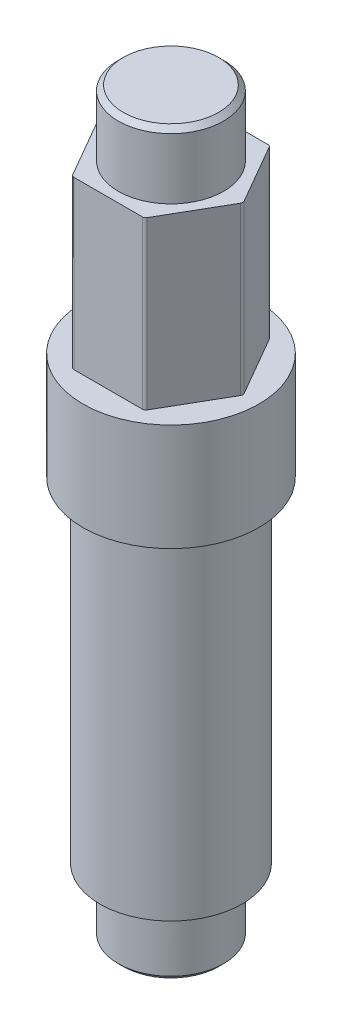
ISO-10303-21;
HEADER;
FILE_DESCRIPTION(('STEP AP214'),'2;1');
FILE_NAME('part.step','',(''),(''),'','','');
FILE_SCHEMA(('AUTOMOTIVE_DESIGN { 1 0 10303 214 1 1 1 1 }'));
ENDSEC;
DATA;
#1=APPLICATION_CONTEXT('core data for automotive mechanical design processes');
#2=APPLICATION_PROTOCOL_DEFINITION('international standard','automotive_design',2000,#1);
#3=PRODUCT_CONTEXT('',#1,'mechanical');
#4=PRODUCT('Part','Part','',(#3));
#5=PRODUCT_RELATED_PRODUCT_CATEGORY('part','',(#4));
#6=PRODUCT_DEFINITION_FORMATION('','',#4);
#7=PRODUCT_DEFINITION_CONTEXT('part definition',#1,'design');
#8=PRODUCT_DEFINITION('design','',#6,#7);
#9=PRODUCT_DEFINITION_SHAPE('','',#8);
#10=(LENGTH_UNIT() NAMED_UNIT(*) SI_UNIT(.MILLI.,.METRE.));
#11=(NAMED_UNIT(*) PLANE_ANGLE_UNIT() SI_UNIT($,.RADIAN.));
#12=(NAMED_UNIT(*) SI_UNIT($,.STERADIAN.) SOLID_ANGLE_UNIT());
#13=UNCERTAINTY_MEASURE_WITH_UNIT(LENGTH_MEASURE(1.E-05),#10,'distance_accuracy_value','');
#14=(GEOMETRIC_REPRESENTATION_CONTEXT(3) GLOBAL_UNCERTAINTY_ASSIGNED_CONTEXT((#13)) GLOBAL_UNIT_ASSIGNED_CONTEXT((#10,
#11,#12)) REPRESENTATION_CONTEXT('',''));
#15=CARTESIAN_POINT('',(0.,0.,0.));
#16=DIRECTION('',(0.,0.,1.));
#17=DIRECTION('',(1.,0.,0.));
#18=AXIS2_PLACEMENT_3D('',#15,#16,#17);
#19=CARTESIAN_POINT('',(-6.6802,46.1772,0.));
#20=DIRECTION('',(0.,1.,0.));
#21=DIRECTION('',(1.,0.,0.));
#22=AXIS2_PLACEMENT_3D('',#19,#20,#21);
#23=PLANE('',#22);
#24=CARTESIAN_POINT('',(0.,46.1772,0.));
#25=DIRECTION('',(0.,1.,0.));
#26=DIRECTION('',(0.,0.,1.));
#27=AXIS2_PLACEMENT_3D('',#24,#25,#26);
#28=CIRCLE('',#27,4.000000001);
#29=CARTESIAN_POINT('',(0.,46.1772,4.000000001));
#30=VERTEX_POINT('',#29);
#31=EDGE_CURVE('E206',#30,#30,#28,.T.);
#32=ORIENTED_EDGE('',*,*,#31,.F.);
#33=EDGE_LOOP('',(#32));
#34=FACE_BOUND('',#33,.T.);
#35=DIRECTION('',(0.5,0.,0.866025403784439));
#36=VECTOR('',#35,1.);
#37=CARTESIAN_POINT('',(-5.42593782984411,46.1772,0.127000000000003));
#38=LINE('',#37,#36);
#39=CARTESIAN_POINT('',(-5.42593782984411,46.1772,0.127000000000003));
#40=VERTEX_POINT('',#39);
#41=CARTESIAN_POINT('',(-2.82295414120268,46.1772,4.6355));
#42=VERTEX_POINT('',#41);
#43=EDGE_CURVE('E296',#40,#42,#38,.T.);
#44=ORIENTED_EDGE('',*,*,#43,.T.);
#45=CARTESIAN_POINT('',(-2.60298368864143,46.1772,4.5085));
#46=DIRECTION('',(0.,1.,0.));
#47=DIRECTION('',(0.,0.,1.));
#48=AXIS2_PLACEMENT_3D('',#45,#46,#47);
#49=CIRCLE('',#48,0.254);
#50=CARTESIAN_POINT('',(-2.60298368864143,46.1772,4.7625));
#51=VERTEX_POINT('',#50);
#52=EDGE_CURVE('E286',#42,#51,#49,.T.);
#53=ORIENTED_EDGE('',*,*,#52,.T.);
#54=DIRECTION('',(1.,0.,0.));
#55=VECTOR('',#54,1.);
#56=CARTESIAN_POINT('',(-2.60298368864143,46.1772,4.7625));
#57=LINE('',#56,#55);
#58=CARTESIAN_POINT('',(2.60298368864142,46.1772,4.7625));
#59=VERTEX_POINT('',#58);
#60=EDGE_CURVE('E11',#51,#59,#57,.T.);
#61=ORIENTED_EDGE('',*,*,#60,.T.);
#62=CARTESIAN_POINT('',(2.60298368864142,46.1772,4.5085));
#63=DIRECTION('',(0.,1.,0.));
#64=DIRECTION('',(0.,0.,1.));
#65=AXIS2_PLACEMENT_3D('',#62,#63,#64);
#66=CIRCLE('',#65,0.254);
#67=CARTESIAN_POINT('',(2.82295414120268,46.1772,4.6355));
#68=VERTEX_POINT('',#67);
#69=EDGE_CURVE('E50',#59,#68,#66,.T.);
#70=ORIENTED_EDGE('',*,*,#69,.T.);
#71=DIRECTION('',(0.5,0.,-0.866025403784439));
#72=VECTOR('',#71,1.);
#73=CARTESIAN_POINT('',(2.82295414120268,46.1772,4.6355));
#74=LINE('',#73,#72);
#75=CARTESIAN_POINT('',(5.4259378298441,46.1772,0.126999999999999));
#76=VERTEX_POINT('',#75);
#77=EDGE_CURVE('E132',#68,#76,#74,.T.);
#78=ORIENTED_EDGE('',*,*,#77,.T.);
#79=CARTESIAN_POINT('',(5.20596737728286,46.1772,0.));
#80=DIRECTION('',(0.,1.,0.));
#81=DIRECTION('',(0.,0.,1.));
#82=AXIS2_PLACEMENT_3D('',#79,#80,#81);
#83=CIRCLE('',#82,0.254);
#84=CARTESIAN_POINT('',(5.4259378298441,46.1772,-0.127000000000003));
#85=VERTEX_POINT('',#84);
#86=EDGE_CURVE('E126',#76,#85,#83,.T.);
#87=ORIENTED_EDGE('',*,*,#86,.T.);
#88=DIRECTION('',(-0.5,0.,-0.866025403784439));
#89=VECTOR('',#88,1.);
#90=CARTESIAN_POINT('',(5.4259378298441,46.1772,-0.127000000000003));
#91=LINE('',#90,#89);
#92=CARTESIAN_POINT('',(2.82295414120266,46.1772,-4.6355));
#93=VERTEX_POINT('',#92);
#94=EDGE_CURVE('E129',#85,#93,#91,.T.);
#95=ORIENTED_EDGE('',*,*,#94,.T.);
#96=CARTESIAN_POINT('',(2.60298368864142,46.1772,-4.5085));
#97=DIRECTION('',(0.,1.,0.));
#98=DIRECTION('',(0.,0.,1.));
#99=AXIS2_PLACEMENT_3D('',#96,#97,#98);
#100=CIRCLE('',#99,0.254);
#101=CARTESIAN_POINT('',(2.60298368864142,46.1772,-4.7625));
#102=VERTEX_POINT('',#101);
#103=EDGE_CURVE('E157',#93,#102,#100,.T.);
#104=ORIENTED_EDGE('',*,*,#103,.T.);
#105=DIRECTION('',(-1.,0.,0.));
#106=VECTOR('',#105,1.);
#107=CARTESIAN_POINT('',(2.60298368864142,46.1772,-4.7625));
#108=LINE('',#107,#106);
#109=CARTESIAN_POINT('',(-2.60298368864143,46.1772,-4.7625));
#110=VERTEX_POINT('',#109);
#111=EDGE_CURVE('E315',#102,#110,#108,.T.);
#112=ORIENTED_EDGE('',*,*,#111,.T.);
#113=CARTESIAN_POINT('',(-2.60298368864143,46.1772,-4.5085));
#114=DIRECTION('',(0.,1.,0.));
#115=DIRECTION('',(0.,0.,1.));
#116=AXIS2_PLACEMENT_3D('',#113,#114,#115);
#117=CIRCLE('',#116,0.254);
#118=CARTESIAN_POINT('',(-2.82295414120268,46.1772,-4.6355));
#119=VERTEX_POINT('',#118);
#120=EDGE_CURVE('E313',#110,#119,#117,.T.);
#121=ORIENTED_EDGE('',*,*,#120,.T.);
#122=DIRECTION('',(-0.5,0.,0.866025403784439));
#123=VECTOR('',#122,1.);
#124=CARTESIAN_POINT('',(-2.82295414120268,46.1772,-4.6355));
#125=LINE('',#124,#123);
#126=CARTESIAN_POINT('',(-5.42593782984411,46.1772,-0.127));
#127=VERTEX_POINT('',#126);
#128=EDGE_CURVE('E244',#119,#127,#125,.T.);
#129=ORIENTED_EDGE('',*,*,#128,.T.);
#130=CARTESIAN_POINT('',(-5.20596737728286,46.1772,0.));
#131=DIRECTION('',(0.,1.,0.));
#132=DIRECTION('',(0.,0.,1.));
#133=AXIS2_PLACEMENT_3D('',#130,#131,#132);
#134=CIRCLE('',#133,0.254);
#135=EDGE_CURVE('E246',#127,#40,#134,.T.);
#136=ORIENTED_EDGE('',*,*,#135,.T.);
#137=EDGE_LOOP('',(#44,#53,#61,#70,#78,#87,#95,#104,#112,#121,#129,#136));
#138=FACE_BOUND('',#137,.T.);
#139=ADVANCED_FACE('F16',(#34,#138),#23,.T.);
#140=CARTESIAN_POINT('',(-4.000000001,51.177199906,0.));
#141=DIRECTION('',(0.,1.,0.));
#142=DIRECTION('',(1.,0.,0.));
#143=AXIS2_PLACEMENT_3D('',#140,#141,#142);
#144=PLANE('',#143);
#145=CARTESIAN_POINT('',(0.,51.177199906,0.));
#146=DIRECTION('',(0.,1.,0.));
#147=DIRECTION('',(0.,0.,1.));
#148=AXIS2_PLACEMENT_3D('',#145,#146,#147);
#149=CIRCLE('',#148,3.61900000100001);
#150=CARTESIAN_POINT('',(0.,51.177199906,3.61900000100001));
#151=VERTEX_POINT('',#150);
#152=EDGE_CURVE('E219',#151,#151,#149,.T.);
#153=ORIENTED_EDGE('',*,*,#152,.T.);
#154=EDGE_LOOP('',(#153));
#155=FACE_BOUND('',#154,.T.);
#156=ADVANCED_FACE('F198',(#155),#144,.T.);
#157=CARTESIAN_POINT('',(-2.60298368864143,33.528,4.7625));
#158=DIRECTION('',(0.,0.,1.));
#159=DIRECTION('',(1.,0.,0.));
#160=AXIS2_PLACEMENT_3D('',#157,#158,#159);
#161=PLANE('',#160);
#162=ORIENTED_EDGE('',*,*,#60,.F.);
#163=DIRECTION('',(0.,1.,0.));
#164=VECTOR('',#163,1.);
#165=CARTESIAN_POINT('',(-2.60298368864143,33.528,4.7625));
#166=LINE('',#165,#164);
#167=CARTESIAN_POINT('',(-2.60298368864143,33.528,4.7625));
#168=VERTEX_POINT('',#167);
#169=EDGE_CURVE('E293',#168,#51,#166,.T.);
#170=ORIENTED_EDGE('',*,*,#169,.F.);
#171=DIRECTION('',(1.,0.,0.));
#172=VECTOR('',#171,1.);
#173=CARTESIAN_POINT('',(-2.60298368864143,33.528,4.7625));
#174=LINE('',#173,#172);
#175=CARTESIAN_POINT('',(2.60298368864142,33.528,4.7625));
#176=VERTEX_POINT('',#175);
#177=EDGE_CURVE('E183',#168,#176,#174,.T.);
#178=ORIENTED_EDGE('',*,*,#177,.T.);
#179=DIRECTION('',(0.,1.,0.));
#180=VECTOR('',#179,1.);
#181=CARTESIAN_POINT('',(2.60298368864142,33.528,4.7625));
#182=LINE('',#181,#180);
#183=EDGE_CURVE('E19',#176,#59,#182,.T.);
#184=ORIENTED_EDGE('',*,*,#183,.T.);
#185=EDGE_LOOP('',(#162,#170,#178,#184));
#186=FACE_BOUND('',#185,.T.);
#187=ADVANCED_FACE('F179',(#186),#161,.T.);
#188=CARTESIAN_POINT('',(2.60298368864142,33.528,4.5085));
#189=DIRECTION('',(0.,1.,0.));
#190=DIRECTION('',(0.,0.,1.));
#191=AXIS2_PLACEMENT_3D('',#188,#189,#190);
#192=CYLINDRICAL_SURFACE('',#191,0.254);
#193=ORIENTED_EDGE('',*,*,#69,.F.);
#194=ORIENTED_EDGE('',*,*,#183,.F.);
#195=CARTESIAN_POINT('',(2.60298368864142,33.528,4.5085));
#196=DIRECTION('',(0.,1.,0.));
#197=DIRECTION('',(0.,0.,1.));
#198=AXIS2_PLACEMENT_3D('',#195,#196,#197);
#199=CIRCLE('',#198,0.254);
#200=CARTESIAN_POINT('',(2.82295414120268,33.528,4.6355));
#201=VERTEX_POINT('',#200);
#202=EDGE_CURVE('E260',#176,#201,#199,.T.);
#203=ORIENTED_EDGE('',*,*,#202,.T.);
#204=DIRECTION('',(0.,1.,0.));
#205=VECTOR('',#204,1.);
#206=CARTESIAN_POINT('',(2.82295414120268,33.528,4.6355));
#207=LINE('',#206,#205);
#208=EDGE_CURVE('E167',#201,#68,#207,.T.);
#209=ORIENTED_EDGE('',*,*,#208,.T.);
#210=EDGE_LOOP('',(#193,#194,#203,#209));
#211=FACE_BOUND('',#210,.T.);
#212=ADVANCED_FACE('F184',(#211),#192,.T.);
#213=CARTESIAN_POINT('',(2.82295414120268,33.528,4.6355));
#214=DIRECTION('',(0.866025403784439,0.,0.5));
#215=DIRECTION('',(0.,-1.,0.));
#216=AXIS2_PLACEMENT_3D('',#213,#214,#215);
#217=PLANE('',#216);
#218=ORIENTED_EDGE('',*,*,#77,.F.);
#219=ORIENTED_EDGE('',*,*,#208,.F.);
#220=DIRECTION('',(0.5,0.,-0.866025403784439));
#221=VECTOR('',#220,1.);
#222=CARTESIAN_POINT('',(2.82295414120268,33.528,4.6355));
#223=LINE('',#222,#221);
#224=CARTESIAN_POINT('',(5.4259378298441,33.528,0.126999999999999));
#225=VERTEX_POINT('',#224);
#226=EDGE_CURVE('E280',#201,#225,#223,.T.);
#227=ORIENTED_EDGE('',*,*,#226,.T.);
#228=DIRECTION('',(0.,1.,0.));
#229=VECTOR('',#228,1.);
#230=CARTESIAN_POINT('',(5.4259378298441,33.528,0.126999999999999));
#231=LINE('',#230,#229);
#232=EDGE_CURVE('E140',#225,#76,#231,.T.);
#233=ORIENTED_EDGE('',*,*,#232,.T.);
#234=EDGE_LOOP('',(#218,#219,#227,#233));
#235=FACE_BOUND('',#234,.T.);
#236=ADVANCED_FACE('F190',(#235),#217,.T.);
#237=CARTESIAN_POINT('',(5.20596737728286,33.528,0.));
#238=DIRECTION('',(0.,1.,0.));
#239=DIRECTION('',(0.,0.,1.));
#240=AXIS2_PLACEMENT_3D('',#237,#238,#239);
#241=CYLINDRICAL_SURFACE('',#240,0.254);
#242=ORIENTED_EDGE('',*,*,#86,.F.);
#243=ORIENTED_EDGE('',*,*,#232,.F.);
#244=CARTESIAN_POINT('',(5.20596737728286,33.528,0.));
#245=DIRECTION('',(0.,1.,0.));
#246=DIRECTION('',(0.,0.,1.));
#247=AXIS2_PLACEMENT_3D('',#244,#245,#246);
#248=CIRCLE('',#247,0.254);
#249=CARTESIAN_POINT('',(5.4259378298441,33.528,-0.127000000000003));
#250=VERTEX_POINT('',#249);
#251=EDGE_CURVE('E145',#225,#250,#248,.T.);
#252=ORIENTED_EDGE('',*,*,#251,.T.);
#253=DIRECTION('',(0.,1.,0.));
#254=VECTOR('',#253,1.);
#255=CARTESIAN_POINT('',(5.4259378298441,33.528,-0.127000000000003));
#256=LINE('',#255,#254);
#257=EDGE_CURVE('E138',#250,#85,#256,.T.);
#258=ORIENTED_EDGE('',*,*,#257,.T.);
#259=EDGE_LOOP('',(#242,#243,#252,#258));
#260=FACE_BOUND('',#259,.T.);
#261=ADVANCED_FACE('F142',(#260),#241,.T.);
#262=CARTESIAN_POINT('',(5.4259378298441,33.528,-0.127000000000003));
#263=DIRECTION('',(0.866025403784439,0.,-0.5));
#264=DIRECTION('',(0.,-1.,0.));
#265=AXIS2_PLACEMENT_3D('',#262,#263,#264);
#266=PLANE('',#265);
#267=ORIENTED_EDGE('',*,*,#94,.F.);
#268=ORIENTED_EDGE('',*,*,#257,.F.);
#269=DIRECTION('',(-0.5,0.,-0.866025403784439));
#270=VECTOR('',#269,1.);
#271=CARTESIAN_POINT('',(5.4259378298441,33.528,-0.127000000000003));
#272=LINE('',#271,#270);
#273=CARTESIAN_POINT('',(2.82295414120266,33.528,-4.6355));
#274=VERTEX_POINT('',#273);
#275=EDGE_CURVE('E265',#250,#274,#272,.T.);
#276=ORIENTED_EDGE('',*,*,#275,.T.);
#277=DIRECTION('',(0.,1.,0.));
#278=VECTOR('',#277,1.);
#279=CARTESIAN_POINT('',(2.82295414120266,33.528,-4.6355));
#280=LINE('',#279,#278);
#281=EDGE_CURVE('E151',#274,#93,#280,.T.);
#282=ORIENTED_EDGE('',*,*,#281,.T.);
#283=EDGE_LOOP('',(#267,#268,#276,#282));
#284=FACE_BOUND('',#283,.T.);
#285=ADVANCED_FACE('F147',(#284),#266,.T.);
#286=CARTESIAN_POINT('',(2.60298368864142,33.528,-4.5085));
#287=DIRECTION('',(0.,1.,0.));
#288=DIRECTION('',(0.,0.,1.));
#289=AXIS2_PLACEMENT_3D('',#286,#287,#288);
#290=CYLINDRICAL_SURFACE('',#289,0.254);
#291=ORIENTED_EDGE('',*,*,#103,.F.);
#292=ORIENTED_EDGE('',*,*,#281,.F.);
#293=CARTESIAN_POINT('',(2.60298368864142,33.528,-4.5085));
#294=DIRECTION('',(0.,1.,0.));
#295=DIRECTION('',(0.,0.,1.));
#296=AXIS2_PLACEMENT_3D('',#293,#294,#295);
#297=CIRCLE('',#296,0.254);
#298=CARTESIAN_POINT('',(2.60298368864142,33.528,-4.7625));
#299=VERTEX_POINT('',#298);
#300=EDGE_CURVE('E256',#274,#299,#297,.T.);
#301=ORIENTED_EDGE('',*,*,#300,.T.);
#302=DIRECTION('',(0.,1.,0.));
#303=VECTOR('',#302,1.);
#304=CARTESIAN_POINT('',(2.60298368864142,33.528,-4.7625));
#305=LINE('',#304,#303);
#306=EDGE_CURVE('E252',#299,#102,#305,.T.);
#307=ORIENTED_EDGE('',*,*,#306,.T.);
#308=EDGE_LOOP('',(#291,#292,#301,#307));
#309=FACE_BOUND('',#308,.T.);
#310=ADVANCED_FACE('F330',(#309),#290,.T.);
#311=CARTESIAN_POINT('',(2.60298368864142,33.528,-4.7625));
#312=DIRECTION('',(0.,0.,-1.));
#313=DIRECTION('',(-1.,0.,0.));
#314=AXIS2_PLACEMENT_3D('',#311,#312,#313);
#315=PLANE('',#314);
#316=ORIENTED_EDGE('',*,*,#111,.F.);
#317=ORIENTED_EDGE('',*,*,#306,.F.);
#318=DIRECTION('',(-1.,0.,0.));
#319=VECTOR('',#318,1.);
#320=CARTESIAN_POINT('',(2.60298368864142,33.528,-4.7625));
#321=LINE('',#320,#319);
#322=CARTESIAN_POINT('',(-2.60298368864143,33.528,-4.7625));
#323=VERTEX_POINT('',#322);
#324=EDGE_CURVE('E231',#299,#323,#321,.T.);
#325=ORIENTED_EDGE('',*,*,#324,.T.);
#326=DIRECTION('',(0.,1.,0.));
#327=VECTOR('',#326,1.);
#328=CARTESIAN_POINT('',(-2.60298368864143,33.528,-4.7625));
#329=LINE('',#328,#327);
#330=EDGE_CURVE('E312',#323,#110,#329,.T.);
#331=ORIENTED_EDGE('',*,*,#330,.T.);
#332=EDGE_LOOP('',(#316,#317,#325,#331));
#333=FACE_BOUND('',#332,.T.);
#334=ADVANCED_FACE('F332',(#333),#315,.T.);
#335=CARTESIAN_POINT('',(-2.60298368864143,33.528,-4.5085));
#336=DIRECTION('',(0.,1.,0.));
#337=DIRECTION('',(0.,0.,1.));
#338=AXIS2_PLACEMENT_3D('',#335,#336,#337);
#339=CYLINDRICAL_SURFACE('',#338,0.254);
#340=ORIENTED_EDGE('',*,*,#120,.F.);
#341=ORIENTED_EDGE('',*,*,#330,.F.);
#342=CARTESIAN_POINT('',(-2.60298368864143,33.528,-4.5085));
#343=DIRECTION('',(0.,1.,0.));
#344=DIRECTION('',(0.,0.,1.));
#345=AXIS2_PLACEMENT_3D('',#342,#343,#344);
#346=CIRCLE('',#345,0.254);
#347=CARTESIAN_POINT('',(-2.82295414120268,33.528,-4.6355));
#348=VERTEX_POINT('',#347);
#349=EDGE_CURVE('E227',#323,#348,#346,.T.);
#350=ORIENTED_EDGE('',*,*,#349,.T.);
#351=DIRECTION('',(0.,1.,0.));
#352=VECTOR('',#351,1.);
#353=CARTESIAN_POINT('',(-2.82295414120268,33.528,-4.6355));
#354=LINE('',#353,#352);
#355=EDGE_CURVE('E307',#348,#119,#354,.T.);
#356=ORIENTED_EDGE('',*,*,#355,.T.);
#357=EDGE_LOOP('',(#340,#341,#350,#356));
#358=FACE_BOUND('',#357,.T.);
#359=ADVANCED_FACE('F336',(#358),#339,.T.);
#360=CARTESIAN_POINT('',(-2.82295414120268,33.528,-4.6355));
#361=DIRECTION('',(-0.866025403784439,0.,-0.5));
#362=DIRECTION('',(-0.5,0.,0.866025403784439));
#363=AXIS2_PLACEMENT_3D('',#360,#361,#362);
#364=PLANE('',#363);
#365=ORIENTED_EDGE('',*,*,#128,.F.);
#366=ORIENTED_EDGE('',*,*,#355,.F.);
#367=DIRECTION('',(-0.5,0.,0.866025403784439));
#368=VECTOR('',#367,1.);
#369=CARTESIAN_POINT('',(-2.82295414120268,33.528,-4.6355));
#370=LINE('',#369,#368);
#371=CARTESIAN_POINT('',(-5.42593782984411,33.528,-0.127));
#372=VERTEX_POINT('',#371);
#373=EDGE_CURVE('E235',#348,#372,#370,.T.);
#374=ORIENTED_EDGE('',*,*,#373,.T.);
#375=DIRECTION('',(0.,1.,0.));
#376=VECTOR('',#375,1.);
#377=CARTESIAN_POINT('',(-5.42593782984411,33.528,-0.127));
#378=LINE('',#377,#376);
#379=EDGE_CURVE('E241',#372,#127,#378,.T.);
#380=ORIENTED_EDGE('',*,*,#379,.T.);
#381=EDGE_LOOP('',(#365,#366,#374,#380));
#382=FACE_BOUND('',#381,.T.);
#383=ADVANCED_FACE('F340',(#382),#364,.T.);
#384=CARTESIAN_POINT('',(-5.20596737728286,33.528,0.));
#385=DIRECTION('',(0.,1.,0.));
#386=DIRECTION('',(0.,0.,1.));
#387=AXIS2_PLACEMENT_3D('',#384,#385,#386);
#388=CYLINDRICAL_SURFACE('',#387,0.254);
#389=ORIENTED_EDGE('',*,*,#135,.F.);
#390=ORIENTED_EDGE('',*,*,#379,.F.);
#391=CARTESIAN_POINT('',(-5.20596737728286,33.528,0.));
#392=DIRECTION('',(0.,1.,0.));
#393=DIRECTION('',(0.,0.,1.));
#394=AXIS2_PLACEMENT_3D('',#391,#392,#393);
#395=CIRCLE('',#394,0.254);
#396=CARTESIAN_POINT('',(-5.42593782984411,33.528,0.127000000000003));
#397=VERTEX_POINT('',#396);
#398=EDGE_CURVE('E266',#372,#397,#395,.T.);
#399=ORIENTED_EDGE('',*,*,#398,.T.);
#400=DIRECTION('',(0.,1.,0.));
#401=VECTOR('',#400,1.);
#402=CARTESIAN_POINT('',(-5.42593782984411,33.528,0.127000000000003));
#403=LINE('',#402,#401);
#404=EDGE_CURVE('E300',#397,#40,#403,.T.);
#405=ORIENTED_EDGE('',*,*,#404,.T.);
#406=EDGE_LOOP('',(#389,#390,#399,#405));
#407=FACE_BOUND('',#406,.T.);
#408=ADVANCED_FACE('F350',(#407),#388,.T.);
#409=CARTESIAN_POINT('',(-5.42593782984411,33.528,0.127000000000003));
#410=DIRECTION('',(-0.866025403784439,0.,0.5));
#411=DIRECTION('',(0.,1.,0.));
#412=AXIS2_PLACEMENT_3D('',#409,#410,#411);
#413=PLANE('',#412);
#414=ORIENTED_EDGE('',*,*,#43,.F.);
#415=ORIENTED_EDGE('',*,*,#404,.F.);
#416=DIRECTION('',(0.5,0.,0.866025403784439));
#417=VECTOR('',#416,1.);
#418=CARTESIAN_POINT('',(-5.42593782984411,33.528,0.127000000000003));
#419=LINE('',#418,#417);
#420=CARTESIAN_POINT('',(-2.82295414120268,33.528,4.6355));
#421=VERTEX_POINT('',#420);
#422=EDGE_CURVE('E249',#397,#421,#419,.T.);
#423=ORIENTED_EDGE('',*,*,#422,.T.);
#424=DIRECTION('',(0.,1.,0.));
#425=VECTOR('',#424,1.);
#426=CARTESIAN_POINT('',(-2.82295414120268,33.528,4.6355));
#427=LINE('',#426,#425);
#428=EDGE_CURVE('E287',#421,#42,#427,.T.);
#429=ORIENTED_EDGE('',*,*,#428,.T.);
#430=EDGE_LOOP('',(#414,#415,#423,#429));
#431=FACE_BOUND('',#430,.T.);
#432=ADVANCED_FACE('F349',(#431),#413,.T.);
#433=CARTESIAN_POINT('',(-2.60298368864143,33.528,4.5085));
#434=DIRECTION('',(0.,1.,0.));
#435=DIRECTION('',(0.,0.,1.));
#436=AXIS2_PLACEMENT_3D('',#433,#434,#435);
#437=CYLINDRICAL_SURFACE('',#436,0.254);
#438=ORIENTED_EDGE('',*,*,#52,.F.);
#439=ORIENTED_EDGE('',*,*,#428,.F.);
#440=CARTESIAN_POINT('',(-2.60298368864143,33.528,4.5085));
#441=DIRECTION('',(0.,1.,0.));
#442=DIRECTION('',(0.,0.,1.));
#443=AXIS2_PLACEMENT_3D('',#440,#441,#442);
#444=CIRCLE('',#443,0.254);
#445=EDGE_CURVE('E258',#421,#168,#444,.T.);
#446=ORIENTED_EDGE('',*,*,#445,.T.);
#447=ORIENTED_EDGE('',*,*,#169,.T.);
#448=EDGE_LOOP('',(#438,#439,#446,#447));
#449=FACE_BOUND('',#448,.T.);
#450=ADVANCED_FACE('F353',(#449),#437,.T.);
#451=CARTESIAN_POINT('',(0.,33.528,0.));
#452=DIRECTION('',(0.,1.,0.));
#453=DIRECTION('',(1.,0.,0.));
#454=AXIS2_PLACEMENT_3D('',#451,#452,#453);
#455=PLANE('',#454);
#456=ORIENTED_EDGE('',*,*,#422,.F.);
#457=ORIENTED_EDGE('',*,*,#398,.F.);
#458=ORIENTED_EDGE('',*,*,#373,.F.);
#459=ORIENTED_EDGE('',*,*,#349,.F.);
#460=ORIENTED_EDGE('',*,*,#324,.F.);
#461=ORIENTED_EDGE('',*,*,#300,.F.);
#462=ORIENTED_EDGE('',*,*,#275,.F.);
#463=ORIENTED_EDGE('',*,*,#251,.F.);
#464=ORIENTED_EDGE('',*,*,#226,.F.);
#465=ORIENTED_EDGE('',*,*,#202,.F.);
#466=ORIENTED_EDGE('',*,*,#177,.F.);
#467=ORIENTED_EDGE('',*,*,#445,.F.);
#468=EDGE_LOOP('',(#456,#457,#458,#459,#460,#461,#462,#463,#464,#465,#466,#467));
#469=FACE_BOUND('',#468,.T.);
#470=CARTESIAN_POINT('',(0.,33.528,0.));
#471=DIRECTION('',(0.,-1.,0.));
#472=DIRECTION('',(0.,0.,1.));
#473=AXIS2_PLACEMENT_3D('',#470,#471,#472);
#474=CIRCLE('',#473,6.6802);
#475=CARTESIAN_POINT('',(0.,33.528,6.6802));
#476=VERTEX_POINT('',#475);
#477=EDGE_CURVE('E239',#476,#476,#474,.T.);
#478=ORIENTED_EDGE('',*,*,#477,.F.);
#479=EDGE_LOOP('',(#478));
#480=FACE_BOUND('',#479,.T.);
#481=ADVANCED_FACE('F356',(#469,#480),#455,.T.);
#482=CARTESIAN_POINT('',(-4.000000001,-4.999999906,0.));
#483=DIRECTION('',(0.,-1.,0.));
#484=DIRECTION('',(0.,0.,-1.));
#485=AXIS2_PLACEMENT_3D('',#482,#483,#484);
#486=PLANE('',#485);
#487=CARTESIAN_POINT('',(0.,-4.999999906,0.));
#488=DIRECTION('',(0.,-1.,0.));
#489=DIRECTION('',(0.,0.,-1.));
#490=AXIS2_PLACEMENT_3D('',#487,#488,#489);
#491=CIRCLE('',#490,3.61900000099999);
#492=CARTESIAN_POINT('',(0.,-4.999999906,-3.61900000099999));
#493=VERTEX_POINT('',#492);
#494=EDGE_CURVE('E578',#493,#493,#491,.T.);
#495=ORIENTED_EDGE('',*,*,#494,.T.);
#496=EDGE_LOOP('',(#495));
#497=FACE_BOUND('',#496,.T.);
#498=ADVANCED_FACE('F774',(#497),#486,.T.);
#499=CARTESIAN_POINT('',(-5.3975,25.4,0.));
#500=DIRECTION('',(0.,-1.,0.));
#501=DIRECTION('',(0.,0.,-1.));
#502=AXIS2_PLACEMENT_3D('',#499,#500,#501);
#503=PLANE('',#502);
#504=CARTESIAN_POINT('',(0.,25.4,0.));
#505=DIRECTION('',(0.,1.,0.));
#506=DIRECTION('',(0.,0.,1.));
#507=AXIS2_PLACEMENT_3D('',#504,#505,#506);
#508=CIRCLE('',#507,5.3975);
#509=CARTESIAN_POINT('',(0.,25.4,5.3975));
#510=VERTEX_POINT('',#509);
#511=EDGE_CURVE('E226',#510,#510,#508,.T.);
#512=ORIENTED_EDGE('',*,*,#511,.T.);
#513=EDGE_LOOP('',(#512));
#514=FACE_BOUND('',#513,.T.);
#515=CARTESIAN_POINT('',(0.,25.4,0.));
#516=DIRECTION('',(0.,1.,0.));
#517=DIRECTION('',(0.,0.,1.));
#518=AXIS2_PLACEMENT_3D('',#515,#516,#517);
#519=CIRCLE('',#518,6.6802);
#520=CARTESIAN_POINT('',(0.,25.4,6.6802));
#521=VERTEX_POINT('',#520);
#522=EDGE_CURVE('E240',#521,#521,#519,.T.);
#523=ORIENTED_EDGE('',*,*,#522,.F.);
#524=EDGE_LOOP('',(#523));
#525=FACE_BOUND('',#524,.T.);
#526=ADVANCED_FACE('F765',(#514,#525),#503,.T.);
#527=CARTESIAN_POINT('',(-4.000000001,0.,0.));
#528=DIRECTION('',(0.,-1.,0.));
#529=DIRECTION('',(0.,0.,-1.));
#530=AXIS2_PLACEMENT_3D('',#527,#528,#529);
#531=PLANE('',#530);
#532=CARTESIAN_POINT('',(0.,0.,0.));
#533=DIRECTION('',(0.,1.,0.));
#534=DIRECTION('',(0.,0.,1.));
#535=AXIS2_PLACEMENT_3D('',#532,#533,#534);
#536=CIRCLE('',#535,4.000000001);
#537=CARTESIAN_POINT('',(0.,0.,4.000000001));
#538=VERTEX_POINT('',#537);
#539=EDGE_CURVE('E207',#538,#538,#536,.T.);
#540=ORIENTED_EDGE('',*,*,#539,.T.);
#541=EDGE_LOOP('',(#540));
#542=FACE_BOUND('',#541,.T.);
#543=CARTESIAN_POINT('',(0.,0.,0.));
#544=DIRECTION('',(0.,1.,0.));
#545=DIRECTION('',(0.,0.,1.));
#546=AXIS2_PLACEMENT_3D('',#543,#544,#545);
#547=CIRCLE('',#546,5.3975);
#548=CARTESIAN_POINT('',(0.,0.,5.3975));
#549=VERTEX_POINT('',#548);
#550=EDGE_CURVE('E220',#549,#549,#547,.T.);
#551=ORIENTED_EDGE('',*,*,#550,.F.);
#552=EDGE_LOOP('',(#551));
#553=FACE_BOUND('',#552,.T.);
#554=ADVANCED_FACE('F457',(#542,#553),#531,.T.);
#555=CARTESIAN_POINT('',(0.,0.,0.));
#556=DIRECTION('',(0.,1.,0.));
#557=DIRECTION('',(0.,0.,1.));
#558=AXIS2_PLACEMENT_3D('',#555,#556,#557);
#559=CYLINDRICAL_SURFACE('',#558,6.6802);
#560=ORIENTED_EDGE('',*,*,#477,.T.);
#561=EDGE_LOOP('',(#560));
#562=FACE_BOUND('',#561,.T.);
#563=ORIENTED_EDGE('',*,*,#522,.T.);
#564=EDGE_LOOP('',(#563));
#565=FACE_BOUND('',#564,.T.);
#566=ADVANCED_FACE('F455',(#562,#565),#559,.T.);
#567=CARTESIAN_POINT('',(0.,0.,0.));
#568=DIRECTION('',(0.,1.,0.));
#569=DIRECTION('',(0.,0.,1.));
#570=AXIS2_PLACEMENT_3D('',#567,#568,#569);
#571=CYLINDRICAL_SURFACE('',#570,5.3975);
#572=ORIENTED_EDGE('',*,*,#511,.F.);
#573=EDGE_LOOP('',(#572));
#574=FACE_BOUND('',#573,.T.);
#575=ORIENTED_EDGE('',*,*,#550,.T.);
#576=EDGE_LOOP('',(#575));
#577=FACE_BOUND('',#576,.T.);
#578=ADVANCED_FACE('F458',(#574,#577),#571,.T.);
#579=CARTESIAN_POINT('',(0.,0.,0.));
#580=DIRECTION('',(0.,1.,0.));
#581=DIRECTION('',(0.,0.,1.));
#582=AXIS2_PLACEMENT_3D('',#579,#580,#581);
#583=CYLINDRICAL_SURFACE('',#582,4.000000001);
#584=ORIENTED_EDGE('',*,*,#539,.F.);
#585=EDGE_LOOP('',(#584));
#586=FACE_BOUND('',#585,.T.);
#587=CARTESIAN_POINT('',(0.,-4.618999906,0.));
#588=DIRECTION('',(0.,1.,0.));
#589=DIRECTION('',(0.,0.,-1.));
#590=AXIS2_PLACEMENT_3D('',#587,#588,#589);
#591=CIRCLE('',#590,4.000000001);
#592=CARTESIAN_POINT('',(0.,-4.618999906,-4.000000001));
#593=VERTEX_POINT('',#592);
#594=EDGE_CURVE('E566',#593,#593,#591,.T.);
#595=ORIENTED_EDGE('',*,*,#594,.T.);
#596=EDGE_LOOP('',(#595));
#597=FACE_BOUND('',#596,.T.);
#598=ADVANCED_FACE('F475',(#586,#597),#583,.T.);
#599=CARTESIAN_POINT('',(0.,0.,0.));
#600=DIRECTION('',(0.,1.,0.));
#601=DIRECTION('',(0.,0.,1.));
#602=AXIS2_PLACEMENT_3D('',#599,#600,#601);
#603=CYLINDRICAL_SURFACE('',#602,4.000000001);
#604=CARTESIAN_POINT('',(0.,50.796199906,0.));
#605=DIRECTION('',(0.,-1.,0.));
#606=DIRECTION('',(0.,0.,1.));
#607=AXIS2_PLACEMENT_3D('',#604,#605,#606);
#608=CIRCLE('',#607,4.000000001);
#609=CARTESIAN_POINT('',(0.,50.796199906,4.000000001));
#610=VERTEX_POINT('',#609);
#611=EDGE_CURVE('E209',#610,#610,#608,.T.);
#612=ORIENTED_EDGE('',*,*,#611,.T.);
#613=EDGE_LOOP('',(#612));
#614=FACE_BOUND('',#613,.T.);
#615=ORIENTED_EDGE('',*,*,#31,.T.);
#616=EDGE_LOOP('',(#615));
#617=FACE_BOUND('',#616,.T.);
#618=ADVANCED_FACE('F486',(#614,#617),#603,.T.);
#619=CARTESIAN_POINT('',(0.,51.177199906,0.));
#620=DIRECTION('',(0.,-1.,0.));
#621=DIRECTION('',(0.,0.,-1.));
#622=AXIS2_PLACEMENT_3D('',#619,#620,#621);
#623=CONICAL_SURFACE('',#622,3.61900000100001,0.785398163397453);
#624=ORIENTED_EDGE('',*,*,#611,.F.);
#625=EDGE_LOOP('',(#624));
#626=FACE_BOUND('',#625,.T.);
#627=ORIENTED_EDGE('',*,*,#152,.F.);
#628=EDGE_LOOP('',(#627));
#629=FACE_BOUND('',#628,.T.);
#630=ADVANCED_FACE('F499',(#626,#629),#623,.T.);
#631=CARTESIAN_POINT('',(0.,-4.618999906,0.));
#632=DIRECTION('',(0.,1.,0.));
#633=DIRECTION('',(0.,0.,1.));
#634=AXIS2_PLACEMENT_3D('',#631,#632,#633);
#635=CONICAL_SURFACE('',#634,4.000000001,0.78539816339745);
#636=ORIENTED_EDGE('',*,*,#594,.F.);
#637=EDGE_LOOP('',(#636));
#638=FACE_BOUND('',#637,.T.);
#639=ORIENTED_EDGE('',*,*,#494,.F.);
#640=EDGE_LOOP('',(#639));
#641=FACE_BOUND('',#640,.T.);
#642=ADVANCED_FACE('F509',(#638,#641),#635,.T.);
#643=CLOSED_SHELL('',(#139,#156,#187,#212,#236,#261,#285,#310,#334,#359,#383,#408,#432,#450,
#481,#498,#526,#554,#566,#578,#598,#618,#630,#642));
#644=MANIFOLD_SOLID_BREP('B1',#643);
#645=ADVANCED_BREP_SHAPE_REPRESENTATION('',(#18,#644),#14);
#646=SHAPE_DEFINITION_REPRESENTATION(#9,#645);
ENDSEC;
END-ISO-10303-21;
